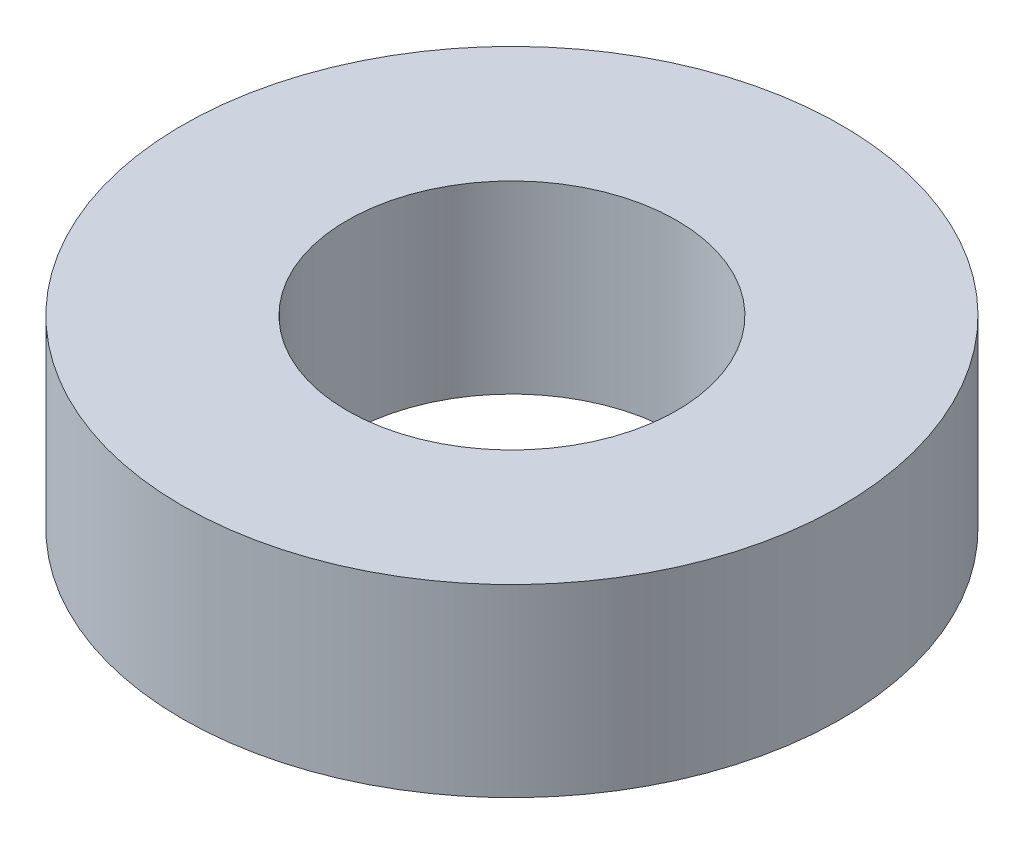
ISO-10303-21;
HEADER;
FILE_DESCRIPTION(('STEP AP214'),'2;1');
FILE_NAME('part.step','',(''),(''),'','','');
FILE_SCHEMA(('AUTOMOTIVE_DESIGN { 1 0 10303 214 1 1 1 1 }'));
ENDSEC;
DATA;
#1=APPLICATION_CONTEXT('core data for automotive mechanical design processes');
#2=APPLICATION_PROTOCOL_DEFINITION('international standard','automotive_design',2000,#1);
#3=PRODUCT_CONTEXT('',#1,'mechanical');
#4=PRODUCT('Part','Part','',(#3));
#5=PRODUCT_RELATED_PRODUCT_CATEGORY('part','',(#4));
#6=PRODUCT_DEFINITION_FORMATION('','',#4);
#7=PRODUCT_DEFINITION_CONTEXT('part definition',#1,'design');
#8=PRODUCT_DEFINITION('design','',#6,#7);
#9=PRODUCT_DEFINITION_SHAPE('','',#8);
#10=(LENGTH_UNIT() NAMED_UNIT(*) SI_UNIT(.MILLI.,.METRE.));
#11=(NAMED_UNIT(*) PLANE_ANGLE_UNIT() SI_UNIT($,.RADIAN.));
#12=(NAMED_UNIT(*) SI_UNIT($,.STERADIAN.) SOLID_ANGLE_UNIT());
#13=UNCERTAINTY_MEASURE_WITH_UNIT(LENGTH_MEASURE(1.E-05),#10,'distance_accuracy_value','');
#14=(GEOMETRIC_REPRESENTATION_CONTEXT(3) GLOBAL_UNCERTAINTY_ASSIGNED_CONTEXT((#13)) GLOBAL_UNIT_ASSIGNED_CONTEXT((#10,
#11,#12)) REPRESENTATION_CONTEXT('',''));
#15=CARTESIAN_POINT('',(0.,0.,0.));
#16=DIRECTION('',(0.,0.,1.));
#17=DIRECTION('',(1.,0.,0.));
#18=AXIS2_PLACEMENT_3D('',#15,#16,#17);
#19=CARTESIAN_POINT('',(0.,28.,0.));
#20=DIRECTION('',(0.,-1.,0.));
#21=DIRECTION('',(0.,0.,-1.));
#22=AXIS2_PLACEMENT_3D('',#19,#20,#21);
#23=CYLINDRICAL_SURFACE('',#22,50.);
#24=CARTESIAN_POINT('',(0.,28.,0.));
#25=DIRECTION('',(0.,1.,0.));
#26=DIRECTION('',(0.,0.,1.));
#27=AXIS2_PLACEMENT_3D('',#24,#25,#26);
#28=CIRCLE('',#27,50.);
#29=CARTESIAN_POINT('',(0.,28.,50.));
#30=VERTEX_POINT('',#29);
#31=EDGE_CURVE('E10',#30,#30,#28,.T.);
#32=ORIENTED_EDGE('',*,*,#31,.F.);
#33=EDGE_LOOP('',(#32));
#34=FACE_BOUND('',#33,.T.);
#35=CARTESIAN_POINT('',(0.,0.,0.));
#36=DIRECTION('',(0.,1.,0.));
#37=DIRECTION('',(0.,0.,1.));
#38=AXIS2_PLACEMENT_3D('',#35,#36,#37);
#39=CIRCLE('',#38,50.);
#40=CARTESIAN_POINT('',(0.,0.,50.));
#41=VERTEX_POINT('',#40);
#42=EDGE_CURVE('E37',#41,#41,#39,.T.);
#43=ORIENTED_EDGE('',*,*,#42,.T.);
#44=EDGE_LOOP('',(#43));
#45=FACE_BOUND('',#44,.T.);
#46=ADVANCED_FACE('F40',(#34,#45),#23,.T.);
#47=CARTESIAN_POINT('',(0.,28.,0.));
#48=DIRECTION('',(0.,1.,0.));
#49=DIRECTION('',(0.,0.,1.));
#50=AXIS2_PLACEMENT_3D('',#47,#48,#49);
#51=PLANE('',#50);
#52=CARTESIAN_POINT('',(0.,28.,0.));
#53=DIRECTION('',(0.,1.,0.));
#54=DIRECTION('',(0.,0.,1.));
#55=AXIS2_PLACEMENT_3D('',#52,#53,#54);
#56=CIRCLE('',#55,25.);
#57=CARTESIAN_POINT('',(0.,28.,25.));
#58=VERTEX_POINT('',#57);
#59=EDGE_CURVE('E50',#58,#58,#56,.T.);
#60=ORIENTED_EDGE('',*,*,#59,.F.);
#61=EDGE_LOOP('',(#60));
#62=FACE_BOUND('',#61,.T.);
#63=ORIENTED_EDGE('',*,*,#31,.T.);
#64=EDGE_LOOP('',(#63));
#65=FACE_BOUND('',#64,.T.);
#66=ADVANCED_FACE('F59',(#62,#65),#51,.T.);
#67=CARTESIAN_POINT('',(0.,0.,0.));
#68=DIRECTION('',(0.,1.,0.));
#69=DIRECTION('',(0.,0.,1.));
#70=AXIS2_PLACEMENT_3D('',#67,#68,#69);
#71=PLANE('',#70);
#72=CARTESIAN_POINT('',(0.,0.,0.));
#73=DIRECTION('',(0.,1.,0.));
#74=DIRECTION('',(0.,0.,1.));
#75=AXIS2_PLACEMENT_3D('',#72,#73,#74);
#76=CIRCLE('',#75,25.);
#77=CARTESIAN_POINT('',(0.,0.,25.));
#78=VERTEX_POINT('',#77);
#79=EDGE_CURVE('E47',#78,#78,#76,.T.);
#80=ORIENTED_EDGE('',*,*,#79,.T.);
#81=EDGE_LOOP('',(#80));
#82=FACE_BOUND('',#81,.T.);
#83=ORIENTED_EDGE('',*,*,#42,.F.);
#84=EDGE_LOOP('',(#83));
#85=FACE_BOUND('',#84,.T.);
#86=ADVANCED_FACE('F58',(#82,#85),#71,.F.);
#87=CARTESIAN_POINT('',(0.,28.,0.));
#88=DIRECTION('',(0.,-1.,0.));
#89=DIRECTION('',(0.,0.,-1.));
#90=AXIS2_PLACEMENT_3D('',#87,#88,#89);
#91=CYLINDRICAL_SURFACE('',#90,25.);
#92=ORIENTED_EDGE('',*,*,#59,.T.);
#93=EDGE_LOOP('',(#92));
#94=FACE_BOUND('',#93,.T.);
#95=ORIENTED_EDGE('',*,*,#79,.F.);
#96=EDGE_LOOP('',(#95));
#97=FACE_BOUND('',#96,.T.);
#98=ADVANCED_FACE('F54',(#94,#97),#91,.F.);
#99=CLOSED_SHELL('',(#46,#66,#86,#98));
#100=MANIFOLD_SOLID_BREP('B2',#99);
#101=ADVANCED_BREP_SHAPE_REPRESENTATION('',(#18,#100),#14);
#102=SHAPE_DEFINITION_REPRESENTATION(#9,#101);
ENDSEC;
END-ISO-10303-21;
